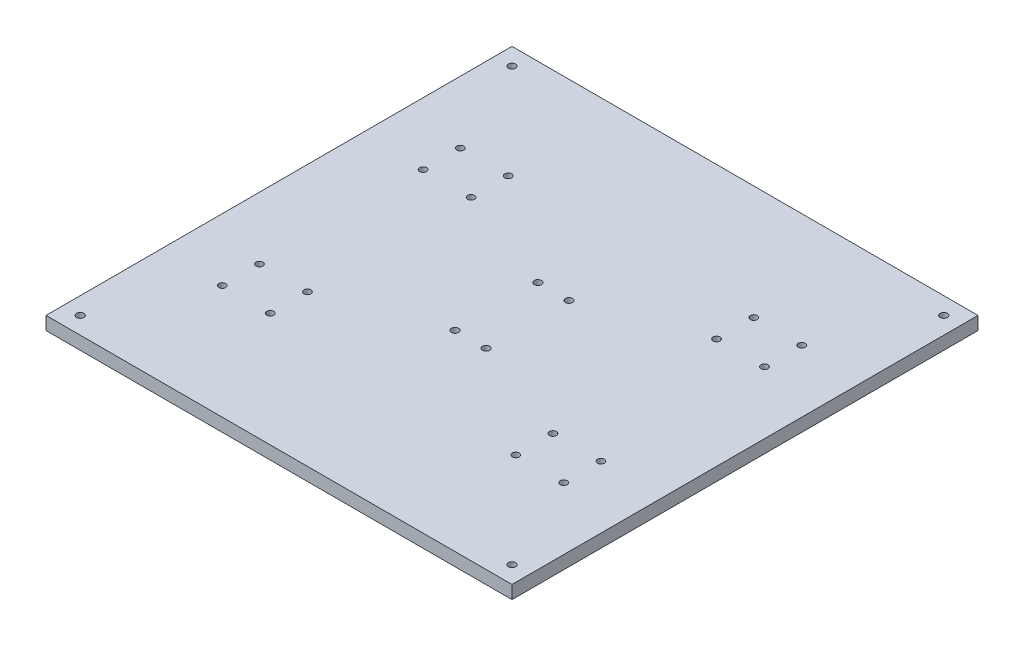
ISO-10303-21;
HEADER;
FILE_DESCRIPTION(('STEP AP214'),'2;1');
FILE_NAME('part.step','',(''),(''),'','','');
FILE_SCHEMA(('AUTOMOTIVE_DESIGN { 1 0 10303 214 1 1 1 1 }'));
ENDSEC;
DATA;
#1=APPLICATION_CONTEXT('core data for automotive mechanical design processes');
#2=APPLICATION_PROTOCOL_DEFINITION('international standard','automotive_design',2000,#1);
#3=PRODUCT_CONTEXT('',#1,'mechanical');
#4=PRODUCT('Part','Part','',(#3));
#5=PRODUCT_RELATED_PRODUCT_CATEGORY('part','',(#4));
#6=PRODUCT_DEFINITION_FORMATION('','',#4);
#7=PRODUCT_DEFINITION_CONTEXT('part definition',#1,'design');
#8=PRODUCT_DEFINITION('design','',#6,#7);
#9=PRODUCT_DEFINITION_SHAPE('','',#8);
#10=(LENGTH_UNIT() NAMED_UNIT(*) SI_UNIT(.MILLI.,.METRE.));
#11=(NAMED_UNIT(*) PLANE_ANGLE_UNIT() SI_UNIT($,.RADIAN.));
#12=(NAMED_UNIT(*) SI_UNIT($,.STERADIAN.) SOLID_ANGLE_UNIT());
#13=UNCERTAINTY_MEASURE_WITH_UNIT(LENGTH_MEASURE(1.E-05),#10,'distance_accuracy_value','');
#14=(GEOMETRIC_REPRESENTATION_CONTEXT(3) GLOBAL_UNCERTAINTY_ASSIGNED_CONTEXT((#13)) GLOBAL_UNIT_ASSIGNED_CONTEXT((#10,
#11,#12)) REPRESENTATION_CONTEXT('',''));
#15=CARTESIAN_POINT('',(0.,0.,0.));
#16=DIRECTION('',(0.,0.,1.));
#17=DIRECTION('',(1.,0.,0.));
#18=AXIS2_PLACEMENT_3D('',#15,#16,#17);
#19=CARTESIAN_POINT('',(0.,6.35,0.));
#20=DIRECTION('',(1.,0.,0.));
#21=DIRECTION('',(0.,0.,-1.));
#22=AXIS2_PLACEMENT_3D('',#19,#20,#21);
#23=PLANE('',#22);
#24=DIRECTION('',(0.,0.,1.));
#25=VECTOR('',#24,1.);
#26=CARTESIAN_POINT('',(0.,0.,0.));
#27=LINE('',#26,#25);
#28=CARTESIAN_POINT('',(0.,0.,-225.));
#29=VERTEX_POINT('',#28);
#30=CARTESIAN_POINT('',(0.,0.,0.));
#31=VERTEX_POINT('',#30);
#32=EDGE_CURVE('E95',#29,#31,#27,.T.);
#33=ORIENTED_EDGE('',*,*,#32,.T.);
#34=DIRECTION('',(0.,-1.,0.));
#35=VECTOR('',#34,1.);
#36=CARTESIAN_POINT('',(0.,6.35,0.));
#37=LINE('',#36,#35);
#38=CARTESIAN_POINT('',(0.,6.35,0.));
#39=VERTEX_POINT('',#38);
#40=EDGE_CURVE('E11',#39,#31,#37,.T.);
#41=ORIENTED_EDGE('',*,*,#40,.F.);
#42=DIRECTION('',(0.,0.,1.));
#43=VECTOR('',#42,1.);
#44=CARTESIAN_POINT('',(0.,6.35,0.));
#45=LINE('',#44,#43);
#46=CARTESIAN_POINT('',(0.,6.35,-225.));
#47=VERTEX_POINT('',#46);
#48=EDGE_CURVE('E83',#47,#39,#45,.T.);
#49=ORIENTED_EDGE('',*,*,#48,.F.);
#50=DIRECTION('',(0.,-1.,0.));
#51=VECTOR('',#50,1.);
#52=CARTESIAN_POINT('',(0.,6.35,-225.));
#53=LINE('',#52,#51);
#54=EDGE_CURVE('E91',#47,#29,#53,.T.);
#55=ORIENTED_EDGE('',*,*,#54,.T.);
#56=EDGE_LOOP('',(#33,#41,#49,#55));
#57=FACE_BOUND('',#56,.T.);
#58=ADVANCED_FACE('F32',(#57),#23,.F.);
#59=CARTESIAN_POINT('',(0.,6.35,0.));
#60=DIRECTION('',(0.,0.,-1.));
#61=DIRECTION('',(-1.,0.,0.));
#62=AXIS2_PLACEMENT_3D('',#59,#60,#61);
#63=PLANE('',#62);
#64=DIRECTION('',(1.,0.,0.));
#65=VECTOR('',#64,1.);
#66=CARTESIAN_POINT('',(0.,0.,0.));
#67=LINE('',#66,#65);
#68=CARTESIAN_POINT('',(225.,0.,0.));
#69=VERTEX_POINT('',#68);
#70=EDGE_CURVE('E87',#31,#69,#67,.T.);
#71=ORIENTED_EDGE('',*,*,#70,.T.);
#72=DIRECTION('',(0.,-1.,0.));
#73=VECTOR('',#72,1.);
#74=CARTESIAN_POINT('',(225.,6.35,0.));
#75=LINE('',#74,#73);
#76=CARTESIAN_POINT('',(225.,6.35,0.));
#77=VERTEX_POINT('',#76);
#78=EDGE_CURVE('E40',#77,#69,#75,.T.);
#79=ORIENTED_EDGE('',*,*,#78,.F.);
#80=DIRECTION('',(1.,0.,0.));
#81=VECTOR('',#80,1.);
#82=CARTESIAN_POINT('',(0.,6.35,0.));
#83=LINE('',#82,#81);
#84=EDGE_CURVE('E78',#39,#77,#83,.T.);
#85=ORIENTED_EDGE('',*,*,#84,.F.);
#86=ORIENTED_EDGE('',*,*,#40,.T.);
#87=EDGE_LOOP('',(#71,#79,#85,#86));
#88=FACE_BOUND('',#87,.T.);
#89=ADVANCED_FACE('F86',(#88),#63,.F.);
#90=CARTESIAN_POINT('',(225.,6.35,0.));
#91=DIRECTION('',(-1.,0.,0.));
#92=DIRECTION('',(0.,0.,1.));
#93=AXIS2_PLACEMENT_3D('',#90,#91,#92);
#94=PLANE('',#93);
#95=DIRECTION('',(0.,0.,-1.));
#96=VECTOR('',#95,1.);
#97=CARTESIAN_POINT('',(225.,0.,0.));
#98=LINE('',#97,#96);
#99=CARTESIAN_POINT('',(225.,0.,-225.));
#100=VERTEX_POINT('',#99);
#101=EDGE_CURVE('E65',#69,#100,#98,.T.);
#102=ORIENTED_EDGE('',*,*,#101,.T.);
#103=DIRECTION('',(0.,-1.,0.));
#104=VECTOR('',#103,1.);
#105=CARTESIAN_POINT('',(225.,6.35,-225.));
#106=LINE('',#105,#104);
#107=CARTESIAN_POINT('',(225.,6.35,-225.));
#108=VERTEX_POINT('',#107);
#109=EDGE_CURVE('E88',#108,#100,#106,.T.);
#110=ORIENTED_EDGE('',*,*,#109,.F.);
#111=DIRECTION('',(0.,0.,-1.));
#112=VECTOR('',#111,1.);
#113=CARTESIAN_POINT('',(225.,6.35,0.));
#114=LINE('',#113,#112);
#115=EDGE_CURVE('E81',#77,#108,#114,.T.);
#116=ORIENTED_EDGE('',*,*,#115,.F.);
#117=ORIENTED_EDGE('',*,*,#78,.T.);
#118=EDGE_LOOP('',(#102,#110,#116,#117));
#119=FACE_BOUND('',#118,.T.);
#120=ADVANCED_FACE('F89',(#119),#94,.F.);
#121=CARTESIAN_POINT('',(0.,6.35,-225.));
#122=DIRECTION('',(0.,0.,1.));
#123=DIRECTION('',(1.,0.,0.));
#124=AXIS2_PLACEMENT_3D('',#121,#122,#123);
#125=PLANE('',#124);
#126=DIRECTION('',(-1.,0.,0.));
#127=VECTOR('',#126,1.);
#128=CARTESIAN_POINT('',(0.,0.,-225.));
#129=LINE('',#128,#127);
#130=EDGE_CURVE('E71',#100,#29,#129,.T.);
#131=ORIENTED_EDGE('',*,*,#130,.T.);
#132=ORIENTED_EDGE('',*,*,#54,.F.);
#133=DIRECTION('',(-1.,0.,0.));
#134=VECTOR('',#133,1.);
#135=CARTESIAN_POINT('',(0.,6.35,-225.));
#136=LINE('',#135,#134);
#137=EDGE_CURVE('E48',#108,#47,#136,.T.);
#138=ORIENTED_EDGE('',*,*,#137,.F.);
#139=ORIENTED_EDGE('',*,*,#109,.T.);
#140=EDGE_LOOP('',(#131,#132,#138,#139));
#141=FACE_BOUND('',#140,.T.);
#142=ADVANCED_FACE('F103',(#141),#125,.F.);
#143=CARTESIAN_POINT('',(0.,6.35,0.));
#144=DIRECTION('',(0.,-1.,0.));
#145=DIRECTION('',(0.,0.,-1.));
#146=AXIS2_PLACEMENT_3D('',#143,#144,#145);
#147=PLANE('',#146);
#148=CARTESIAN_POINT('',(30.08,6.35,-169.96));
#149=DIRECTION('',(0.,-1.,0.));
#150=DIRECTION('',(0.,0.,-1.));
#151=AXIS2_PLACEMENT_3D('',#148,#149,#150);
#152=CIRCLE('',#151,1.67500000000001);
#153=CARTESIAN_POINT('',(30.08,6.35,-171.635));
#154=VERTEX_POINT('',#153);
#155=EDGE_CURVE('E190',#154,#154,#152,.T.);
#156=ORIENTED_EDGE('',*,*,#155,.T.);
#157=EDGE_LOOP('',(#156));
#158=FACE_BOUND('',#157,.T.);
#159=CARTESIAN_POINT('',(30.08,6.35,-55.04));
#160=DIRECTION('',(0.,-1.,0.));
#161=DIRECTION('',(0.,0.,1.));
#162=AXIS2_PLACEMENT_3D('',#159,#160,#161);
#163=CIRCLE('',#162,1.675);
#164=CARTESIAN_POINT('',(30.08,6.35,-53.365));
#165=VERTEX_POINT('',#164);
#166=EDGE_CURVE('E197',#165,#165,#163,.T.);
#167=ORIENTED_EDGE('',*,*,#166,.T.);
#168=EDGE_LOOP('',(#167));
#169=FACE_BOUND('',#168,.T.);
#170=CARTESIAN_POINT('',(53.24,6.35,-55.04));
#171=DIRECTION('',(0.,-1.,0.));
#172=DIRECTION('',(0.,0.,1.));
#173=AXIS2_PLACEMENT_3D('',#170,#171,#172);
#174=CIRCLE('',#173,1.675);
#175=CARTESIAN_POINT('',(53.24,6.35,-53.365));
#176=VERTEX_POINT('',#175);
#177=EDGE_CURVE('E203',#176,#176,#174,.T.);
#178=ORIENTED_EDGE('',*,*,#177,.T.);
#179=EDGE_LOOP('',(#178));
#180=FACE_BOUND('',#179,.T.);
#181=CARTESIAN_POINT('',(53.24,6.35,-72.99));
#182=DIRECTION('',(0.,-1.,0.));
#183=DIRECTION('',(0.,0.,1.));
#184=AXIS2_PLACEMENT_3D('',#181,#182,#183);
#185=CIRCLE('',#184,1.675);
#186=CARTESIAN_POINT('',(53.24,6.35,-71.315));
#187=VERTEX_POINT('',#186);
#188=EDGE_CURVE('E167',#187,#187,#185,.T.);
#189=ORIENTED_EDGE('',*,*,#188,.T.);
#190=EDGE_LOOP('',(#189));
#191=FACE_BOUND('',#190,.T.);
#192=CARTESIAN_POINT('',(30.08,6.35,-72.99));
#193=DIRECTION('',(0.,-1.,0.));
#194=DIRECTION('',(0.,0.,1.));
#195=AXIS2_PLACEMENT_3D('',#192,#193,#194);
#196=CIRCLE('',#195,1.675);
#197=CARTESIAN_POINT('',(30.08,6.35,-71.315));
#198=VERTEX_POINT('',#197);
#199=EDGE_CURVE('E166',#198,#198,#196,.T.);
#200=ORIENTED_EDGE('',*,*,#199,.T.);
#201=EDGE_LOOP('',(#200));
#202=FACE_BOUND('',#201,.T.);
#203=CARTESIAN_POINT('',(171.76,6.35,-72.99));
#204=DIRECTION('',(0.,-1.,0.));
#205=DIRECTION('',(0.,0.,-1.));
#206=AXIS2_PLACEMENT_3D('',#203,#204,#205);
#207=CIRCLE('',#206,1.675);
#208=CARTESIAN_POINT('',(171.76,6.35,-74.665));
#209=VERTEX_POINT('',#208);
#210=EDGE_CURVE('E173',#209,#209,#207,.T.);
#211=ORIENTED_EDGE('',*,*,#210,.T.);
#212=EDGE_LOOP('',(#211));
#213=FACE_BOUND('',#212,.T.);
#214=CARTESIAN_POINT('',(194.92,6.35,-72.99));
#215=DIRECTION('',(0.,-1.,0.));
#216=DIRECTION('',(0.,0.,-1.));
#217=AXIS2_PLACEMENT_3D('',#214,#215,#216);
#218=CIRCLE('',#217,1.675);
#219=CARTESIAN_POINT('',(194.92,6.35,-74.665));
#220=VERTEX_POINT('',#219);
#221=EDGE_CURVE('E179',#220,#220,#218,.T.);
#222=ORIENTED_EDGE('',*,*,#221,.T.);
#223=EDGE_LOOP('',(#222));
#224=FACE_BOUND('',#223,.T.);
#225=CARTESIAN_POINT('',(194.92,6.35,-55.04));
#226=DIRECTION('',(0.,-1.,0.));
#227=DIRECTION('',(0.,0.,-1.));
#228=AXIS2_PLACEMENT_3D('',#225,#226,#227);
#229=CIRCLE('',#228,1.675);
#230=CARTESIAN_POINT('',(194.92,6.35,-56.715));
#231=VERTEX_POINT('',#230);
#232=EDGE_CURVE('E160',#231,#231,#229,.T.);
#233=ORIENTED_EDGE('',*,*,#232,.T.);
#234=EDGE_LOOP('',(#233));
#235=FACE_BOUND('',#234,.T.);
#236=CARTESIAN_POINT('',(171.76,6.35,-169.96));
#237=DIRECTION('',(0.,-1.,0.));
#238=DIRECTION('',(0.,0.,1.));
#239=AXIS2_PLACEMENT_3D('',#236,#237,#238);
#240=CIRCLE('',#239,1.675);
#241=CARTESIAN_POINT('',(171.76,6.35,-168.285));
#242=VERTEX_POINT('',#241);
#243=EDGE_CURVE('E238',#242,#242,#240,.T.);
#244=ORIENTED_EDGE('',*,*,#243,.T.);
#245=EDGE_LOOP('',(#244));
#246=FACE_BOUND('',#245,.T.);
#247=CARTESIAN_POINT('',(194.92,6.35,-169.96));
#248=DIRECTION('',(0.,-1.,0.));
#249=DIRECTION('',(0.,0.,1.));
#250=AXIS2_PLACEMENT_3D('',#247,#248,#249);
#251=CIRCLE('',#250,1.675);
#252=CARTESIAN_POINT('',(194.92,6.35,-168.285));
#253=VERTEX_POINT('',#252);
#254=EDGE_CURVE('E244',#253,#253,#251,.T.);
#255=ORIENTED_EDGE('',*,*,#254,.T.);
#256=EDGE_LOOP('',(#255));
#257=FACE_BOUND('',#256,.T.);
#258=CARTESIAN_POINT('',(194.92,6.35,-152.01));
#259=DIRECTION('',(0.,-1.,0.));
#260=DIRECTION('',(0.,0.,1.));
#261=AXIS2_PLACEMENT_3D('',#258,#259,#260);
#262=CIRCLE('',#261,1.675);
#263=CARTESIAN_POINT('',(194.92,6.35,-150.335));
#264=VERTEX_POINT('',#263);
#265=EDGE_CURVE('E227',#264,#264,#262,.T.);
#266=ORIENTED_EDGE('',*,*,#265,.T.);
#267=EDGE_LOOP('',(#266));
#268=FACE_BOUND('',#267,.T.);
#269=CARTESIAN_POINT('',(53.24,6.35,-169.96));
#270=DIRECTION('',(0.,-1.,0.));
#271=DIRECTION('',(0.,0.,-1.));
#272=AXIS2_PLACEMENT_3D('',#269,#270,#271);
#273=CIRCLE('',#272,1.675);
#274=CARTESIAN_POINT('',(53.24,6.35,-171.635));
#275=VERTEX_POINT('',#274);
#276=EDGE_CURVE('E191',#275,#275,#273,.T.);
#277=ORIENTED_EDGE('',*,*,#276,.T.);
#278=EDGE_LOOP('',(#277));
#279=FACE_BOUND('',#278,.T.);
#280=CARTESIAN_POINT('',(53.24,6.35,-152.01));
#281=DIRECTION('',(0.,-1.,0.));
#282=DIRECTION('',(0.,0.,-1.));
#283=AXIS2_PLACEMENT_3D('',#280,#281,#282);
#284=CIRCLE('',#283,1.67500000000001);
#285=CARTESIAN_POINT('',(53.24,6.35,-153.685));
#286=VERTEX_POINT('',#285);
#287=EDGE_CURVE('E214',#286,#286,#284,.T.);
#288=ORIENTED_EDGE('',*,*,#287,.T.);
#289=EDGE_LOOP('',(#288));
#290=FACE_BOUND('',#289,.T.);
#291=CARTESIAN_POINT('',(30.08,6.35,-152.01));
#292=DIRECTION('',(0.,-1.,0.));
#293=DIRECTION('',(0.,0.,-1.));
#294=AXIS2_PLACEMENT_3D('',#291,#292,#293);
#295=CIRCLE('',#294,1.67500000000001);
#296=CARTESIAN_POINT('',(30.08,6.35,-153.685));
#297=VERTEX_POINT('',#296);
#298=EDGE_CURVE('E215',#297,#297,#295,.T.);
#299=ORIENTED_EDGE('',*,*,#298,.T.);
#300=EDGE_LOOP('',(#299));
#301=FACE_BOUND('',#300,.T.);
#302=CARTESIAN_POINT('',(171.76,6.35,-152.01));
#303=DIRECTION('',(0.,-1.,0.));
#304=DIRECTION('',(0.,0.,1.));
#305=AXIS2_PLACEMENT_3D('',#302,#303,#304);
#306=CIRCLE('',#305,1.675);
#307=CARTESIAN_POINT('',(171.76,6.35,-150.335));
#308=VERTEX_POINT('',#307);
#309=EDGE_CURVE('E226',#308,#308,#306,.T.);
#310=ORIENTED_EDGE('',*,*,#309,.T.);
#311=EDGE_LOOP('',(#310));
#312=FACE_BOUND('',#311,.T.);
#313=CARTESIAN_POINT('',(171.76,6.35,-55.04));
#314=DIRECTION('',(0.,-1.,0.));
#315=DIRECTION('',(0.,0.,-1.));
#316=AXIS2_PLACEMENT_3D('',#313,#314,#315);
#317=CIRCLE('',#316,1.675);
#318=CARTESIAN_POINT('',(171.76,6.35,-56.715));
#319=VERTEX_POINT('',#318);
#320=EDGE_CURVE('E154',#319,#319,#317,.T.);
#321=ORIENTED_EDGE('',*,*,#320,.T.);
#322=EDGE_LOOP('',(#321));
#323=FACE_BOUND('',#322,.T.);
#324=CARTESIAN_POINT('',(105.,6.35,-92.5));
#325=DIRECTION('',(0.,1.,0.));
#326=DIRECTION('',(0.,0.,1.));
#327=AXIS2_PLACEMENT_3D('',#324,#325,#326);
#328=CIRCLE('',#327,1.75);
#329=CARTESIAN_POINT('',(105.,6.35,-90.75));
#330=VERTEX_POINT('',#329);
#331=EDGE_CURVE('E146',#330,#330,#328,.T.);
#332=ORIENTED_EDGE('',*,*,#331,.F.);
#333=EDGE_LOOP('',(#332));
#334=FACE_BOUND('',#333,.T.);
#335=CARTESIAN_POINT('',(120.,6.35,-132.5));
#336=DIRECTION('',(0.,1.,0.));
#337=DIRECTION('',(0.,0.,1.));
#338=AXIS2_PLACEMENT_3D('',#335,#336,#337);
#339=CIRCLE('',#338,1.75000000000001);
#340=CARTESIAN_POINT('',(120.,6.35,-130.75));
#341=VERTEX_POINT('',#340);
#342=EDGE_CURVE('E139',#341,#341,#339,.T.);
#343=ORIENTED_EDGE('',*,*,#342,.F.);
#344=EDGE_LOOP('',(#343));
#345=FACE_BOUND('',#344,.T.);
#346=CARTESIAN_POINT('',(105.,6.35,-132.5));
#347=DIRECTION('',(0.,1.,0.));
#348=DIRECTION('',(0.,0.,1.));
#349=AXIS2_PLACEMENT_3D('',#346,#347,#348);
#350=CIRCLE('',#349,1.75);
#351=CARTESIAN_POINT('',(105.,6.35,-130.75));
#352=VERTEX_POINT('',#351);
#353=EDGE_CURVE('E151',#352,#352,#350,.T.);
#354=ORIENTED_EDGE('',*,*,#353,.F.);
#355=EDGE_LOOP('',(#354));
#356=FACE_BOUND('',#355,.T.);
#357=CARTESIAN_POINT('',(120.,6.35,-92.5));
#358=DIRECTION('',(0.,1.,0.));
#359=DIRECTION('',(0.,0.,1.));
#360=AXIS2_PLACEMENT_3D('',#357,#358,#359);
#361=CIRCLE('',#360,1.75000000000001);
#362=CARTESIAN_POINT('',(120.,6.35,-90.75));
#363=VERTEX_POINT('',#362);
#364=EDGE_CURVE('E133',#363,#363,#361,.T.);
#365=ORIENTED_EDGE('',*,*,#364,.F.);
#366=EDGE_LOOP('',(#365));
#367=FACE_BOUND('',#366,.T.);
#368=CARTESIAN_POINT('',(8.25999999999999,6.35,-216.74));
#369=DIRECTION('',(0.,1.,0.));
#370=DIRECTION('',(0.,0.,-1.));
#371=AXIS2_PLACEMENT_3D('',#368,#369,#370);
#372=CIRCLE('',#371,1.75000000000001);
#373=CARTESIAN_POINT('',(8.25999999999999,6.35,-218.49));
#374=VERTEX_POINT('',#373);
#375=EDGE_CURVE('E122',#374,#374,#372,.T.);
#376=ORIENTED_EDGE('',*,*,#375,.F.);
#377=EDGE_LOOP('',(#376));
#378=FACE_BOUND('',#377,.T.);
#379=CARTESIAN_POINT('',(216.74,6.35,-8.26000000000002));
#380=DIRECTION('',(0.,1.,0.));
#381=DIRECTION('',(0.,0.,-1.));
#382=AXIS2_PLACEMENT_3D('',#379,#380,#381);
#383=CIRCLE('',#382,1.75000000000001);
#384=CARTESIAN_POINT('',(216.74,6.35,-10.01));
#385=VERTEX_POINT('',#384);
#386=EDGE_CURVE('E115',#385,#385,#383,.T.);
#387=ORIENTED_EDGE('',*,*,#386,.F.);
#388=EDGE_LOOP('',(#387));
#389=FACE_BOUND('',#388,.T.);
#390=CARTESIAN_POINT('',(8.26000000000002,6.35,-8.25999999999996));
#391=DIRECTION('',(0.,1.,0.));
#392=DIRECTION('',(0.,0.,1.));
#393=AXIS2_PLACEMENT_3D('',#390,#391,#392);
#394=CIRCLE('',#393,1.75000000000001);
#395=CARTESIAN_POINT('',(8.26000000000002,6.35,-6.50999999999995));
#396=VERTEX_POINT('',#395);
#397=EDGE_CURVE('E127',#396,#396,#394,.T.);
#398=ORIENTED_EDGE('',*,*,#397,.F.);
#399=EDGE_LOOP('',(#398));
#400=FACE_BOUND('',#399,.T.);
#401=CARTESIAN_POINT('',(216.74,6.35,-216.74));
#402=DIRECTION('',(0.,1.,0.));
#403=DIRECTION('',(0.,0.,1.));
#404=AXIS2_PLACEMENT_3D('',#401,#402,#403);
#405=CIRCLE('',#404,1.75000000000001);
#406=CARTESIAN_POINT('',(216.74,6.35,-214.99));
#407=VERTEX_POINT('',#406);
#408=EDGE_CURVE('E109',#407,#407,#405,.T.);
#409=ORIENTED_EDGE('',*,*,#408,.F.);
#410=EDGE_LOOP('',(#409));
#411=FACE_BOUND('',#410,.T.);
#412=ORIENTED_EDGE('',*,*,#48,.T.);
#413=ORIENTED_EDGE('',*,*,#84,.T.);
#414=ORIENTED_EDGE('',*,*,#115,.T.);
#415=ORIENTED_EDGE('',*,*,#137,.T.);
#416=EDGE_LOOP('',(#412,#413,#414,#415));
#417=FACE_BOUND('',#416,.T.);
#418=ADVANCED_FACE('F79',(#158,#169,#180,#191,#202,#213,#224,#235,#246,#257,#268,#279,#290,#301,
#312,#323,#334,#345,#356,#367,#378,#389,#400,#411,#417),#147,.F.);
#419=CARTESIAN_POINT('',(0.,0.,0.));
#420=DIRECTION('',(0.,-1.,0.));
#421=DIRECTION('',(0.,0.,-1.));
#422=AXIS2_PLACEMENT_3D('',#419,#420,#421);
#423=PLANE('',#422);
#424=CARTESIAN_POINT('',(30.08,0.,-169.96));
#425=DIRECTION('',(0.,-1.,0.));
#426=DIRECTION('',(0.,0.,-1.));
#427=AXIS2_PLACEMENT_3D('',#424,#425,#426);
#428=CIRCLE('',#427,1.67500000000001);
#429=CARTESIAN_POINT('',(30.08,0.,-171.635));
#430=VERTEX_POINT('',#429);
#431=EDGE_CURVE('E187',#430,#430,#428,.T.);
#432=ORIENTED_EDGE('',*,*,#431,.F.);
#433=EDGE_LOOP('',(#432));
#434=FACE_BOUND('',#433,.T.);
#435=CARTESIAN_POINT('',(30.08,0.,-55.04));
#436=DIRECTION('',(0.,-1.,0.));
#437=DIRECTION('',(0.,0.,1.));
#438=AXIS2_PLACEMENT_3D('',#435,#436,#437);
#439=CIRCLE('',#438,1.675);
#440=CARTESIAN_POINT('',(30.08,0.,-53.365));
#441=VERTEX_POINT('',#440);
#442=EDGE_CURVE('E194',#441,#441,#439,.T.);
#443=ORIENTED_EDGE('',*,*,#442,.F.);
#444=EDGE_LOOP('',(#443));
#445=FACE_BOUND('',#444,.T.);
#446=CARTESIAN_POINT('',(53.24,0.,-55.04));
#447=DIRECTION('',(0.,-1.,0.));
#448=DIRECTION('',(0.,0.,1.));
#449=AXIS2_PLACEMENT_3D('',#446,#447,#448);
#450=CIRCLE('',#449,1.675);
#451=CARTESIAN_POINT('',(53.24,0.,-53.365));
#452=VERTEX_POINT('',#451);
#453=EDGE_CURVE('E200',#452,#452,#450,.T.);
#454=ORIENTED_EDGE('',*,*,#453,.F.);
#455=EDGE_LOOP('',(#454));
#456=FACE_BOUND('',#455,.T.);
#457=CARTESIAN_POINT('',(53.24,0.,-72.99));
#458=DIRECTION('',(0.,-1.,0.));
#459=DIRECTION('',(0.,0.,1.));
#460=AXIS2_PLACEMENT_3D('',#457,#458,#459);
#461=CIRCLE('',#460,1.675);
#462=CARTESIAN_POINT('',(53.24,0.,-71.315));
#463=VERTEX_POINT('',#462);
#464=EDGE_CURVE('E206',#463,#463,#461,.T.);
#465=ORIENTED_EDGE('',*,*,#464,.F.);
#466=EDGE_LOOP('',(#465));
#467=FACE_BOUND('',#466,.T.);
#468=CARTESIAN_POINT('',(30.08,0.,-72.99));
#469=DIRECTION('',(0.,-1.,0.));
#470=DIRECTION('',(0.,0.,1.));
#471=AXIS2_PLACEMENT_3D('',#468,#469,#470);
#472=CIRCLE('',#471,1.675);
#473=CARTESIAN_POINT('',(30.08,0.,-71.315));
#474=VERTEX_POINT('',#473);
#475=EDGE_CURVE('E163',#474,#474,#472,.T.);
#476=ORIENTED_EDGE('',*,*,#475,.F.);
#477=EDGE_LOOP('',(#476));
#478=FACE_BOUND('',#477,.T.);
#479=CARTESIAN_POINT('',(171.76,0.,-72.99));
#480=DIRECTION('',(0.,-1.,0.));
#481=DIRECTION('',(0.,0.,-1.));
#482=AXIS2_PLACEMENT_3D('',#479,#480,#481);
#483=CIRCLE('',#482,1.675);
#484=CARTESIAN_POINT('',(171.76,0.,-74.665));
#485=VERTEX_POINT('',#484);
#486=EDGE_CURVE('E170',#485,#485,#483,.T.);
#487=ORIENTED_EDGE('',*,*,#486,.F.);
#488=EDGE_LOOP('',(#487));
#489=FACE_BOUND('',#488,.T.);
#490=CARTESIAN_POINT('',(194.92,0.,-72.99));
#491=DIRECTION('',(0.,-1.,0.));
#492=DIRECTION('',(0.,0.,-1.));
#493=AXIS2_PLACEMENT_3D('',#490,#491,#492);
#494=CIRCLE('',#493,1.675);
#495=CARTESIAN_POINT('',(194.92,0.,-74.665));
#496=VERTEX_POINT('',#495);
#497=EDGE_CURVE('E176',#496,#496,#494,.T.);
#498=ORIENTED_EDGE('',*,*,#497,.F.);
#499=EDGE_LOOP('',(#498));
#500=FACE_BOUND('',#499,.T.);
#501=CARTESIAN_POINT('',(194.92,0.,-55.04));
#502=DIRECTION('',(0.,-1.,0.));
#503=DIRECTION('',(0.,0.,-1.));
#504=AXIS2_PLACEMENT_3D('',#501,#502,#503);
#505=CIRCLE('',#504,1.675);
#506=CARTESIAN_POINT('',(194.92,0.,-56.715));
#507=VERTEX_POINT('',#506);
#508=EDGE_CURVE('E182',#507,#507,#505,.T.);
#509=ORIENTED_EDGE('',*,*,#508,.F.);
#510=EDGE_LOOP('',(#509));
#511=FACE_BOUND('',#510,.T.);
#512=CARTESIAN_POINT('',(171.76,0.,-169.96));
#513=DIRECTION('',(0.,-1.,0.));
#514=DIRECTION('',(0.,0.,1.));
#515=AXIS2_PLACEMENT_3D('',#512,#513,#514);
#516=CIRCLE('',#515,1.675);
#517=CARTESIAN_POINT('',(171.76,0.,-168.285));
#518=VERTEX_POINT('',#517);
#519=EDGE_CURVE('E235',#518,#518,#516,.T.);
#520=ORIENTED_EDGE('',*,*,#519,.F.);
#521=EDGE_LOOP('',(#520));
#522=FACE_BOUND('',#521,.T.);
#523=CARTESIAN_POINT('',(194.92,0.,-169.96));
#524=DIRECTION('',(0.,-1.,0.));
#525=DIRECTION('',(0.,0.,1.));
#526=AXIS2_PLACEMENT_3D('',#523,#524,#525);
#527=CIRCLE('',#526,1.675);
#528=CARTESIAN_POINT('',(194.92,0.,-168.285));
#529=VERTEX_POINT('',#528);
#530=EDGE_CURVE('E241',#529,#529,#527,.T.);
#531=ORIENTED_EDGE('',*,*,#530,.F.);
#532=EDGE_LOOP('',(#531));
#533=FACE_BOUND('',#532,.T.);
#534=CARTESIAN_POINT('',(194.92,0.,-152.01));
#535=DIRECTION('',(0.,-1.,0.));
#536=DIRECTION('',(0.,0.,1.));
#537=AXIS2_PLACEMENT_3D('',#534,#535,#536);
#538=CIRCLE('',#537,1.675);
#539=CARTESIAN_POINT('',(194.92,0.,-150.335));
#540=VERTEX_POINT('',#539);
#541=EDGE_CURVE('E247',#540,#540,#538,.T.);
#542=ORIENTED_EDGE('',*,*,#541,.F.);
#543=EDGE_LOOP('',(#542));
#544=FACE_BOUND('',#543,.T.);
#545=CARTESIAN_POINT('',(53.24,0.,-169.96));
#546=DIRECTION('',(0.,-1.,0.));
#547=DIRECTION('',(0.,0.,-1.));
#548=AXIS2_PLACEMENT_3D('',#545,#546,#547);
#549=CIRCLE('',#548,1.675);
#550=CARTESIAN_POINT('',(53.24,0.,-171.635));
#551=VERTEX_POINT('',#550);
#552=EDGE_CURVE('E218',#551,#551,#549,.T.);
#553=ORIENTED_EDGE('',*,*,#552,.F.);
#554=EDGE_LOOP('',(#553));
#555=FACE_BOUND('',#554,.T.);
#556=CARTESIAN_POINT('',(53.24,0.,-152.01));
#557=DIRECTION('',(0.,-1.,0.));
#558=DIRECTION('',(0.,0.,-1.));
#559=AXIS2_PLACEMENT_3D('',#556,#557,#558);
#560=CIRCLE('',#559,1.67500000000001);
#561=CARTESIAN_POINT('',(53.24,0.,-153.685));
#562=VERTEX_POINT('',#561);
#563=EDGE_CURVE('E211',#562,#562,#560,.T.);
#564=ORIENTED_EDGE('',*,*,#563,.F.);
#565=EDGE_LOOP('',(#564));
#566=FACE_BOUND('',#565,.T.);
#567=CARTESIAN_POINT('',(30.08,0.,-152.01));
#568=DIRECTION('',(0.,-1.,0.));
#569=DIRECTION('',(0.,0.,-1.));
#570=AXIS2_PLACEMENT_3D('',#567,#568,#569);
#571=CIRCLE('',#570,1.67500000000001);
#572=CARTESIAN_POINT('',(30.08,0.,-153.685));
#573=VERTEX_POINT('',#572);
#574=EDGE_CURVE('E230',#573,#573,#571,.T.);
#575=ORIENTED_EDGE('',*,*,#574,.F.);
#576=EDGE_LOOP('',(#575));
#577=FACE_BOUND('',#576,.T.);
#578=CARTESIAN_POINT('',(171.76,0.,-152.01));
#579=DIRECTION('',(0.,-1.,0.));
#580=DIRECTION('',(0.,0.,1.));
#581=AXIS2_PLACEMENT_3D('',#578,#579,#580);
#582=CIRCLE('',#581,1.675);
#583=CARTESIAN_POINT('',(171.76,0.,-150.335));
#584=VERTEX_POINT('',#583);
#585=EDGE_CURVE('E223',#584,#584,#582,.T.);
#586=ORIENTED_EDGE('',*,*,#585,.F.);
#587=EDGE_LOOP('',(#586));
#588=FACE_BOUND('',#587,.T.);
#589=CARTESIAN_POINT('',(171.76,0.,-55.04));
#590=DIRECTION('',(0.,-1.,0.));
#591=DIRECTION('',(0.,0.,-1.));
#592=AXIS2_PLACEMENT_3D('',#589,#590,#591);
#593=CIRCLE('',#592,1.675);
#594=CARTESIAN_POINT('',(171.76,0.,-56.715));
#595=VERTEX_POINT('',#594);
#596=EDGE_CURVE('E157',#595,#595,#593,.T.);
#597=ORIENTED_EDGE('',*,*,#596,.F.);
#598=EDGE_LOOP('',(#597));
#599=FACE_BOUND('',#598,.T.);
#600=CARTESIAN_POINT('',(105.,0.,-92.5));
#601=DIRECTION('',(0.,1.,0.));
#602=DIRECTION('',(0.,0.,1.));
#603=AXIS2_PLACEMENT_3D('',#600,#601,#602);
#604=CIRCLE('',#603,1.75);
#605=CARTESIAN_POINT('',(105.,0.,-90.75));
#606=VERTEX_POINT('',#605);
#607=EDGE_CURVE('E136',#606,#606,#604,.T.);
#608=ORIENTED_EDGE('',*,*,#607,.T.);
#609=EDGE_LOOP('',(#608));
#610=FACE_BOUND('',#609,.T.);
#611=CARTESIAN_POINT('',(120.,0.,-132.5));
#612=DIRECTION('',(0.,1.,0.));
#613=DIRECTION('',(0.,0.,1.));
#614=AXIS2_PLACEMENT_3D('',#611,#612,#613);
#615=CIRCLE('',#614,1.75000000000001);
#616=CARTESIAN_POINT('',(120.,0.,-130.75));
#617=VERTEX_POINT('',#616);
#618=EDGE_CURVE('E142',#617,#617,#615,.T.);
#619=ORIENTED_EDGE('',*,*,#618,.T.);
#620=EDGE_LOOP('',(#619));
#621=FACE_BOUND('',#620,.T.);
#622=CARTESIAN_POINT('',(105.,0.,-132.5));
#623=DIRECTION('',(0.,1.,0.));
#624=DIRECTION('',(0.,0.,1.));
#625=AXIS2_PLACEMENT_3D('',#622,#623,#624);
#626=CIRCLE('',#625,1.75);
#627=CARTESIAN_POINT('',(105.,0.,-130.75));
#628=VERTEX_POINT('',#627);
#629=EDGE_CURVE('E143',#628,#628,#626,.T.);
#630=ORIENTED_EDGE('',*,*,#629,.T.);
#631=EDGE_LOOP('',(#630));
#632=FACE_BOUND('',#631,.T.);
#633=CARTESIAN_POINT('',(120.,0.,-92.5));
#634=DIRECTION('',(0.,1.,0.));
#635=DIRECTION('',(0.,0.,1.));
#636=AXIS2_PLACEMENT_3D('',#633,#634,#635);
#637=CIRCLE('',#636,1.75000000000001);
#638=CARTESIAN_POINT('',(120.,0.,-90.75));
#639=VERTEX_POINT('',#638);
#640=EDGE_CURVE('E130',#639,#639,#637,.T.);
#641=ORIENTED_EDGE('',*,*,#640,.T.);
#642=EDGE_LOOP('',(#641));
#643=FACE_BOUND('',#642,.T.);
#644=CARTESIAN_POINT('',(8.25999999999999,0.,-216.74));
#645=DIRECTION('',(0.,1.,0.));
#646=DIRECTION('',(0.,0.,-1.));
#647=AXIS2_PLACEMENT_3D('',#644,#645,#646);
#648=CIRCLE('',#647,1.75000000000001);
#649=CARTESIAN_POINT('',(8.25999999999999,0.,-218.49));
#650=VERTEX_POINT('',#649);
#651=EDGE_CURVE('E112',#650,#650,#648,.T.);
#652=ORIENTED_EDGE('',*,*,#651,.T.);
#653=EDGE_LOOP('',(#652));
#654=FACE_BOUND('',#653,.T.);
#655=CARTESIAN_POINT('',(216.74,0.,-8.26000000000002));
#656=DIRECTION('',(0.,1.,0.));
#657=DIRECTION('',(0.,0.,-1.));
#658=AXIS2_PLACEMENT_3D('',#655,#656,#657);
#659=CIRCLE('',#658,1.75000000000001);
#660=CARTESIAN_POINT('',(216.74,0.,-10.01));
#661=VERTEX_POINT('',#660);
#662=EDGE_CURVE('E118',#661,#661,#659,.T.);
#663=ORIENTED_EDGE('',*,*,#662,.T.);
#664=EDGE_LOOP('',(#663));
#665=FACE_BOUND('',#664,.T.);
#666=CARTESIAN_POINT('',(8.26000000000002,0.,-8.25999999999996));
#667=DIRECTION('',(0.,1.,0.));
#668=DIRECTION('',(0.,0.,1.));
#669=AXIS2_PLACEMENT_3D('',#666,#667,#668);
#670=CIRCLE('',#669,1.75000000000001);
#671=CARTESIAN_POINT('',(8.26000000000002,0.,-6.50999999999995));
#672=VERTEX_POINT('',#671);
#673=EDGE_CURVE('E119',#672,#672,#670,.T.);
#674=ORIENTED_EDGE('',*,*,#673,.T.);
#675=EDGE_LOOP('',(#674));
#676=FACE_BOUND('',#675,.T.);
#677=CARTESIAN_POINT('',(216.74,0.,-216.74));
#678=DIRECTION('',(0.,1.,0.));
#679=DIRECTION('',(0.,0.,1.));
#680=AXIS2_PLACEMENT_3D('',#677,#678,#679);
#681=CIRCLE('',#680,1.75000000000001);
#682=CARTESIAN_POINT('',(216.74,0.,-214.99));
#683=VERTEX_POINT('',#682);
#684=EDGE_CURVE('E98',#683,#683,#681,.T.);
#685=ORIENTED_EDGE('',*,*,#684,.T.);
#686=EDGE_LOOP('',(#685));
#687=FACE_BOUND('',#686,.T.);
#688=ORIENTED_EDGE('',*,*,#32,.F.);
#689=ORIENTED_EDGE('',*,*,#130,.F.);
#690=ORIENTED_EDGE('',*,*,#101,.F.);
#691=ORIENTED_EDGE('',*,*,#70,.F.);
#692=EDGE_LOOP('',(#688,#689,#690,#691));
#693=FACE_BOUND('',#692,.T.);
#694=ADVANCED_FACE('F106',(#434,#445,#456,#467,#478,#489,#500,#511,#522,#533,#544,#555,#566,
#577,#588,#599,#610,#621,#632,#643,#654,#665,#676,#687,#693),#423,.T.);
#695=CARTESIAN_POINT('',(216.74,0.,-216.74));
#696=DIRECTION('',(0.,1.,0.));
#697=DIRECTION('',(0.,0.,1.));
#698=AXIS2_PLACEMENT_3D('',#695,#696,#697);
#699=CYLINDRICAL_SURFACE('',#698,1.75000000000001);
#700=ORIENTED_EDGE('',*,*,#684,.F.);
#701=EDGE_LOOP('',(#700));
#702=FACE_BOUND('',#701,.T.);
#703=ORIENTED_EDGE('',*,*,#408,.T.);
#704=EDGE_LOOP('',(#703));
#705=FACE_BOUND('',#704,.T.);
#706=ADVANCED_FACE('F265',(#702,#705),#699,.F.);
#707=CARTESIAN_POINT('',(8.26000000000002,0.,-8.25999999999996));
#708=DIRECTION('',(0.,1.,0.));
#709=DIRECTION('',(0.,0.,1.));
#710=AXIS2_PLACEMENT_3D('',#707,#708,#709);
#711=CYLINDRICAL_SURFACE('',#710,1.75000000000001);
#712=ORIENTED_EDGE('',*,*,#673,.F.);
#713=EDGE_LOOP('',(#712));
#714=FACE_BOUND('',#713,.T.);
#715=ORIENTED_EDGE('',*,*,#397,.T.);
#716=EDGE_LOOP('',(#715));
#717=FACE_BOUND('',#716,.T.);
#718=ADVANCED_FACE('F296',(#714,#717),#711,.F.);
#719=CARTESIAN_POINT('',(216.74,0.,-8.26000000000002));
#720=DIRECTION('',(0.,1.,0.));
#721=DIRECTION('',(0.,0.,1.));
#722=AXIS2_PLACEMENT_3D('',#719,#720,#721);
#723=CYLINDRICAL_SURFACE('',#722,1.75000000000001);
#724=ORIENTED_EDGE('',*,*,#662,.F.);
#725=EDGE_LOOP('',(#724));
#726=FACE_BOUND('',#725,.T.);
#727=ORIENTED_EDGE('',*,*,#386,.T.);
#728=EDGE_LOOP('',(#727));
#729=FACE_BOUND('',#728,.T.);
#730=ADVANCED_FACE('F339',(#726,#729),#723,.F.);
#731=CARTESIAN_POINT('',(8.25999999999999,0.,-216.74));
#732=DIRECTION('',(0.,1.,0.));
#733=DIRECTION('',(0.,0.,1.));
#734=AXIS2_PLACEMENT_3D('',#731,#732,#733);
#735=CYLINDRICAL_SURFACE('',#734,1.75000000000001);
#736=ORIENTED_EDGE('',*,*,#651,.F.);
#737=EDGE_LOOP('',(#736));
#738=FACE_BOUND('',#737,.T.);
#739=ORIENTED_EDGE('',*,*,#375,.T.);
#740=EDGE_LOOP('',(#739));
#741=FACE_BOUND('',#740,.T.);
#742=ADVANCED_FACE('F349',(#738,#741),#735,.F.);
#743=CARTESIAN_POINT('',(120.,0.,-92.5));
#744=DIRECTION('',(0.,1.,0.));
#745=DIRECTION('',(0.,0.,1.));
#746=AXIS2_PLACEMENT_3D('',#743,#744,#745);
#747=CYLINDRICAL_SURFACE('',#746,1.75000000000001);
#748=ORIENTED_EDGE('',*,*,#640,.F.);
#749=EDGE_LOOP('',(#748));
#750=FACE_BOUND('',#749,.T.);
#751=ORIENTED_EDGE('',*,*,#364,.T.);
#752=EDGE_LOOP('',(#751));
#753=FACE_BOUND('',#752,.T.);
#754=ADVANCED_FACE('F359',(#750,#753),#747,.F.);
#755=CARTESIAN_POINT('',(105.,0.,-132.5));
#756=DIRECTION('',(0.,1.,0.));
#757=DIRECTION('',(0.,0.,1.));
#758=AXIS2_PLACEMENT_3D('',#755,#756,#757);
#759=CYLINDRICAL_SURFACE('',#758,1.75);
#760=ORIENTED_EDGE('',*,*,#629,.F.);
#761=EDGE_LOOP('',(#760));
#762=FACE_BOUND('',#761,.T.);
#763=ORIENTED_EDGE('',*,*,#353,.T.);
#764=EDGE_LOOP('',(#763));
#765=FACE_BOUND('',#764,.T.);
#766=ADVANCED_FACE('F369',(#762,#765),#759,.F.);
#767=CARTESIAN_POINT('',(120.,0.,-132.5));
#768=DIRECTION('',(0.,1.,0.));
#769=DIRECTION('',(0.,0.,1.));
#770=AXIS2_PLACEMENT_3D('',#767,#768,#769);
#771=CYLINDRICAL_SURFACE('',#770,1.75000000000001);
#772=ORIENTED_EDGE('',*,*,#618,.F.);
#773=EDGE_LOOP('',(#772));
#774=FACE_BOUND('',#773,.T.);
#775=ORIENTED_EDGE('',*,*,#342,.T.);
#776=EDGE_LOOP('',(#775));
#777=FACE_BOUND('',#776,.T.);
#778=ADVANCED_FACE('F379',(#774,#777),#771,.F.);
#779=CARTESIAN_POINT('',(105.,0.,-92.5));
#780=DIRECTION('',(0.,1.,0.));
#781=DIRECTION('',(0.,0.,1.));
#782=AXIS2_PLACEMENT_3D('',#779,#780,#781);
#783=CYLINDRICAL_SURFACE('',#782,1.75);
#784=ORIENTED_EDGE('',*,*,#607,.F.);
#785=EDGE_LOOP('',(#784));
#786=FACE_BOUND('',#785,.T.);
#787=ORIENTED_EDGE('',*,*,#331,.T.);
#788=EDGE_LOOP('',(#787));
#789=FACE_BOUND('',#788,.T.);
#790=ADVANCED_FACE('F389',(#786,#789),#783,.F.);
#791=CARTESIAN_POINT('',(171.76,6.35,-55.04));
#792=DIRECTION('',(0.,-1.,0.));
#793=DIRECTION('',(0.,0.,-1.));
#794=AXIS2_PLACEMENT_3D('',#791,#792,#793);
#795=CYLINDRICAL_SURFACE('',#794,1.675);
#796=ORIENTED_EDGE('',*,*,#320,.F.);
#797=EDGE_LOOP('',(#796));
#798=FACE_BOUND('',#797,.T.);
#799=ORIENTED_EDGE('',*,*,#596,.T.);
#800=EDGE_LOOP('',(#799));
#801=FACE_BOUND('',#800,.T.);
#802=ADVANCED_FACE('F398',(#798,#801),#795,.F.);
#803=CARTESIAN_POINT('',(171.76,6.35,-152.01));
#804=DIRECTION('',(0.,-1.,0.));
#805=DIRECTION('',(0.,0.,-1.));
#806=AXIS2_PLACEMENT_3D('',#803,#804,#805);
#807=CYLINDRICAL_SURFACE('',#806,1.675);
#808=ORIENTED_EDGE('',*,*,#309,.F.);
#809=EDGE_LOOP('',(#808));
#810=FACE_BOUND('',#809,.T.);
#811=ORIENTED_EDGE('',*,*,#585,.T.);
#812=EDGE_LOOP('',(#811));
#813=FACE_BOUND('',#812,.T.);
#814=ADVANCED_FACE('F417',(#810,#813),#807,.F.);
#815=CARTESIAN_POINT('',(30.08,6.35,-152.01));
#816=DIRECTION('',(0.,-1.,0.));
#817=DIRECTION('',(0.,0.,-1.));
#818=AXIS2_PLACEMENT_3D('',#815,#816,#817);
#819=CYLINDRICAL_SURFACE('',#818,1.67500000000001);
#820=ORIENTED_EDGE('',*,*,#298,.F.);
#821=EDGE_LOOP('',(#820));
#822=FACE_BOUND('',#821,.T.);
#823=ORIENTED_EDGE('',*,*,#574,.T.);
#824=EDGE_LOOP('',(#823));
#825=FACE_BOUND('',#824,.T.);
#826=ADVANCED_FACE('F427',(#822,#825),#819,.F.);
#827=CARTESIAN_POINT('',(53.24,6.35,-152.01));
#828=DIRECTION('',(0.,-1.,0.));
#829=DIRECTION('',(0.,0.,-1.));
#830=AXIS2_PLACEMENT_3D('',#827,#828,#829);
#831=CYLINDRICAL_SURFACE('',#830,1.67500000000001);
#832=ORIENTED_EDGE('',*,*,#287,.F.);
#833=EDGE_LOOP('',(#832));
#834=FACE_BOUND('',#833,.T.);
#835=ORIENTED_EDGE('',*,*,#563,.T.);
#836=EDGE_LOOP('',(#835));
#837=FACE_BOUND('',#836,.T.);
#838=ADVANCED_FACE('F437',(#834,#837),#831,.F.);
#839=CARTESIAN_POINT('',(53.24,6.35,-169.96));
#840=DIRECTION('',(0.,-1.,0.));
#841=DIRECTION('',(0.,0.,-1.));
#842=AXIS2_PLACEMENT_3D('',#839,#840,#841);
#843=CYLINDRICAL_SURFACE('',#842,1.675);
#844=ORIENTED_EDGE('',*,*,#276,.F.);
#845=EDGE_LOOP('',(#844));
#846=FACE_BOUND('',#845,.T.);
#847=ORIENTED_EDGE('',*,*,#552,.T.);
#848=EDGE_LOOP('',(#847));
#849=FACE_BOUND('',#848,.T.);
#850=ADVANCED_FACE('F259',(#846,#849),#843,.F.);
#851=CARTESIAN_POINT('',(194.92,6.35,-152.01));
#852=DIRECTION('',(0.,-1.,0.));
#853=DIRECTION('',(0.,0.,-1.));
#854=AXIS2_PLACEMENT_3D('',#851,#852,#853);
#855=CYLINDRICAL_SURFACE('',#854,1.675);
#856=ORIENTED_EDGE('',*,*,#265,.F.);
#857=EDGE_LOOP('',(#856));
#858=FACE_BOUND('',#857,.T.);
#859=ORIENTED_EDGE('',*,*,#541,.T.);
#860=EDGE_LOOP('',(#859));
#861=FACE_BOUND('',#860,.T.);
#862=ADVANCED_FACE('F255',(#858,#861),#855,.F.);
#863=CARTESIAN_POINT('',(194.92,6.35,-169.96));
#864=DIRECTION('',(0.,-1.,0.));
#865=DIRECTION('',(0.,0.,-1.));
#866=AXIS2_PLACEMENT_3D('',#863,#864,#865);
#867=CYLINDRICAL_SURFACE('',#866,1.675);
#868=ORIENTED_EDGE('',*,*,#254,.F.);
#869=EDGE_LOOP('',(#868));
#870=FACE_BOUND('',#869,.T.);
#871=ORIENTED_EDGE('',*,*,#530,.T.);
#872=EDGE_LOOP('',(#871));
#873=FACE_BOUND('',#872,.T.);
#874=ADVANCED_FACE('F258',(#870,#873),#867,.F.);
#875=CARTESIAN_POINT('',(171.76,6.35,-169.96));
#876=DIRECTION('',(0.,-1.,0.));
#877=DIRECTION('',(0.,0.,-1.));
#878=AXIS2_PLACEMENT_3D('',#875,#876,#877);
#879=CYLINDRICAL_SURFACE('',#878,1.675);
#880=ORIENTED_EDGE('',*,*,#243,.F.);
#881=EDGE_LOOP('',(#880));
#882=FACE_BOUND('',#881,.T.);
#883=ORIENTED_EDGE('',*,*,#519,.T.);
#884=EDGE_LOOP('',(#883));
#885=FACE_BOUND('',#884,.T.);
#886=ADVANCED_FACE('F471',(#882,#885),#879,.F.);
#887=CARTESIAN_POINT('',(194.92,6.35,-55.04));
#888=DIRECTION('',(0.,-1.,0.));
#889=DIRECTION('',(0.,0.,-1.));
#890=AXIS2_PLACEMENT_3D('',#887,#888,#889);
#891=CYLINDRICAL_SURFACE('',#890,1.675);
#892=ORIENTED_EDGE('',*,*,#232,.F.);
#893=EDGE_LOOP('',(#892));
#894=FACE_BOUND('',#893,.T.);
#895=ORIENTED_EDGE('',*,*,#508,.T.);
#896=EDGE_LOOP('',(#895));
#897=FACE_BOUND('',#896,.T.);
#898=ADVANCED_FACE('F481',(#894,#897),#891,.F.);
#899=CARTESIAN_POINT('',(194.92,6.35,-72.99));
#900=DIRECTION('',(0.,-1.,0.));
#901=DIRECTION('',(0.,0.,-1.));
#902=AXIS2_PLACEMENT_3D('',#899,#900,#901);
#903=CYLINDRICAL_SURFACE('',#902,1.675);
#904=ORIENTED_EDGE('',*,*,#221,.F.);
#905=EDGE_LOOP('',(#904));
#906=FACE_BOUND('',#905,.T.);
#907=ORIENTED_EDGE('',*,*,#497,.T.);
#908=EDGE_LOOP('',(#907));
#909=FACE_BOUND('',#908,.T.);
#910=ADVANCED_FACE('F491',(#906,#909),#903,.F.);
#911=CARTESIAN_POINT('',(171.76,6.35,-72.99));
#912=DIRECTION('',(0.,-1.,0.));
#913=DIRECTION('',(0.,0.,-1.));
#914=AXIS2_PLACEMENT_3D('',#911,#912,#913);
#915=CYLINDRICAL_SURFACE('',#914,1.675);
#916=ORIENTED_EDGE('',*,*,#210,.F.);
#917=EDGE_LOOP('',(#916));
#918=FACE_BOUND('',#917,.T.);
#919=ORIENTED_EDGE('',*,*,#486,.T.);
#920=EDGE_LOOP('',(#919));
#921=FACE_BOUND('',#920,.T.);
#922=ADVANCED_FACE('F501',(#918,#921),#915,.F.);
#923=CARTESIAN_POINT('',(30.08,6.35,-72.99));
#924=DIRECTION('',(0.,-1.,0.));
#925=DIRECTION('',(0.,0.,-1.));
#926=AXIS2_PLACEMENT_3D('',#923,#924,#925);
#927=CYLINDRICAL_SURFACE('',#926,1.675);
#928=ORIENTED_EDGE('',*,*,#199,.F.);
#929=EDGE_LOOP('',(#928));
#930=FACE_BOUND('',#929,.T.);
#931=ORIENTED_EDGE('',*,*,#475,.T.);
#932=EDGE_LOOP('',(#931));
#933=FACE_BOUND('',#932,.T.);
#934=ADVANCED_FACE('F511',(#930,#933),#927,.F.);
#935=CARTESIAN_POINT('',(53.24,6.35,-72.99));
#936=DIRECTION('',(0.,-1.,0.));
#937=DIRECTION('',(0.,0.,-1.));
#938=AXIS2_PLACEMENT_3D('',#935,#936,#937);
#939=CYLINDRICAL_SURFACE('',#938,1.675);
#940=ORIENTED_EDGE('',*,*,#188,.F.);
#941=EDGE_LOOP('',(#940));
#942=FACE_BOUND('',#941,.T.);
#943=ORIENTED_EDGE('',*,*,#464,.T.);
#944=EDGE_LOOP('',(#943));
#945=FACE_BOUND('',#944,.T.);
#946=ADVANCED_FACE('F521',(#942,#945),#939,.F.);
#947=CARTESIAN_POINT('',(53.24,6.35,-55.04));
#948=DIRECTION('',(0.,-1.,0.));
#949=DIRECTION('',(0.,0.,-1.));
#950=AXIS2_PLACEMENT_3D('',#947,#948,#949);
#951=CYLINDRICAL_SURFACE('',#950,1.675);
#952=ORIENTED_EDGE('',*,*,#177,.F.);
#953=EDGE_LOOP('',(#952));
#954=FACE_BOUND('',#953,.T.);
#955=ORIENTED_EDGE('',*,*,#453,.T.);
#956=EDGE_LOOP('',(#955));
#957=FACE_BOUND('',#956,.T.);
#958=ADVANCED_FACE('F531',(#954,#957),#951,.F.);
#959=CARTESIAN_POINT('',(30.08,6.35,-55.04));
#960=DIRECTION('',(0.,-1.,0.));
#961=DIRECTION('',(0.,0.,-1.));
#962=AXIS2_PLACEMENT_3D('',#959,#960,#961);
#963=CYLINDRICAL_SURFACE('',#962,1.675);
#964=ORIENTED_EDGE('',*,*,#166,.F.);
#965=EDGE_LOOP('',(#964));
#966=FACE_BOUND('',#965,.T.);
#967=ORIENTED_EDGE('',*,*,#442,.T.);
#968=EDGE_LOOP('',(#967));
#969=FACE_BOUND('',#968,.T.);
#970=ADVANCED_FACE('F541',(#966,#969),#963,.F.);
#971=CARTESIAN_POINT('',(30.08,6.35,-169.96));
#972=DIRECTION('',(0.,-1.,0.));
#973=DIRECTION('',(0.,0.,-1.));
#974=AXIS2_PLACEMENT_3D('',#971,#972,#973);
#975=CYLINDRICAL_SURFACE('',#974,1.67500000000001);
#976=ORIENTED_EDGE('',*,*,#155,.F.);
#977=EDGE_LOOP('',(#976));
#978=FACE_BOUND('',#977,.T.);
#979=ORIENTED_EDGE('',*,*,#431,.T.);
#980=EDGE_LOOP('',(#979));
#981=FACE_BOUND('',#980,.T.);
#982=ADVANCED_FACE('F551',(#978,#981),#975,.F.);
#983=CLOSED_SHELL('',(#58,#89,#120,#142,#418,#694,#706,#718,#730,#742,#754,#766,#778,#790,#802,
#814,#826,#838,#850,#862,#874,#886,#898,#910,#922,#934,#946,#958,#970,#982));
#984=MANIFOLD_SOLID_BREP('B2',#983);
#985=ADVANCED_BREP_SHAPE_REPRESENTATION('',(#18,#984),#14);
#986=SHAPE_DEFINITION_REPRESENTATION(#9,#985);
ENDSEC;
END-ISO-10303-21;
